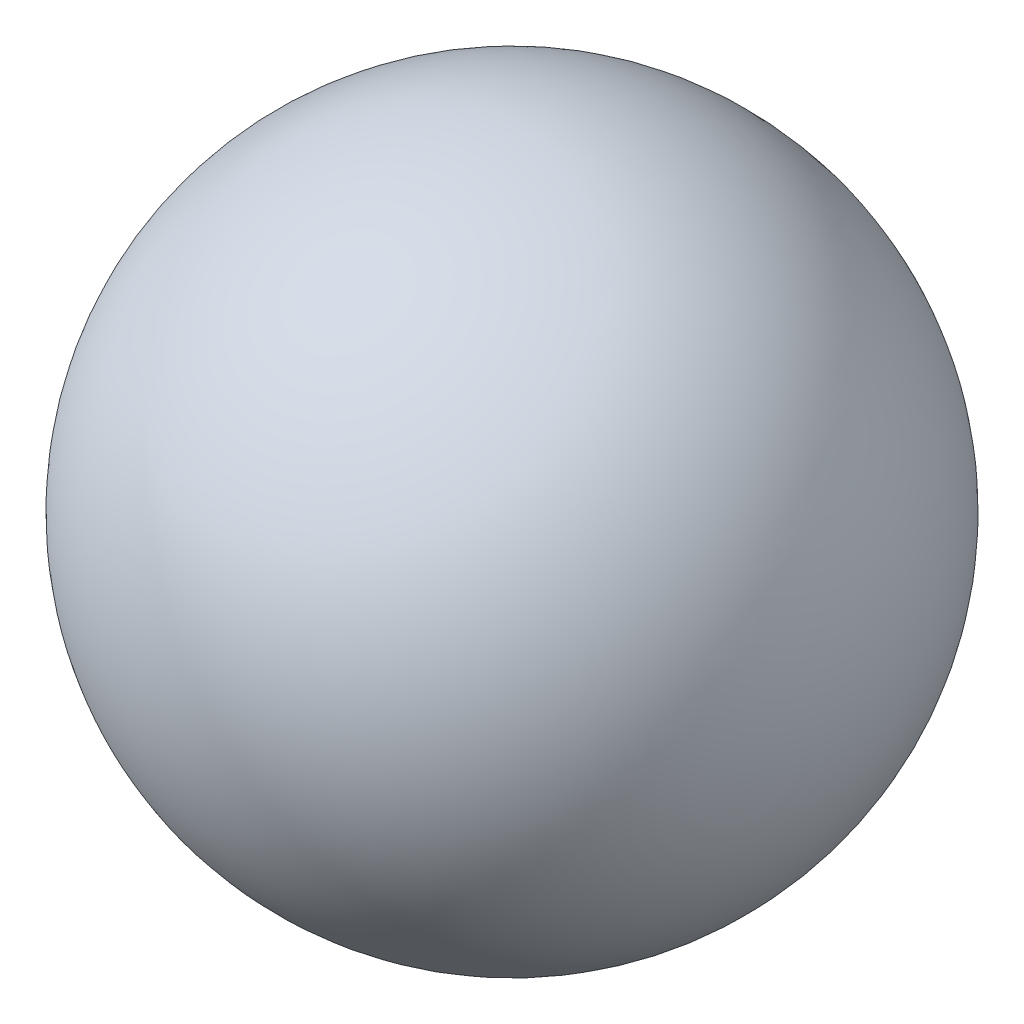
ISO-10303-21;
HEADER;
FILE_DESCRIPTION(('STEP AP214'),'2;1');
FILE_NAME('part.step','',(''),(''),'','','');
FILE_SCHEMA(('AUTOMOTIVE_DESIGN { 1 0 10303 214 1 1 1 1 }'));
ENDSEC;
DATA;
#1=APPLICATION_CONTEXT('core data for automotive mechanical design processes');
#2=APPLICATION_PROTOCOL_DEFINITION('international standard','automotive_design',2000,#1);
#3=PRODUCT_CONTEXT('',#1,'mechanical');
#4=PRODUCT('Part','Part','',(#3));
#5=PRODUCT_RELATED_PRODUCT_CATEGORY('part','',(#4));
#6=PRODUCT_DEFINITION_FORMATION('','',#4);
#7=PRODUCT_DEFINITION_CONTEXT('part definition',#1,'design');
#8=PRODUCT_DEFINITION('design','',#6,#7);
#9=PRODUCT_DEFINITION_SHAPE('','',#8);
#10=(LENGTH_UNIT() NAMED_UNIT(*) SI_UNIT(.MILLI.,.METRE.));
#11=(NAMED_UNIT(*) PLANE_ANGLE_UNIT() SI_UNIT($,.RADIAN.));
#12=(NAMED_UNIT(*) SI_UNIT($,.STERADIAN.) SOLID_ANGLE_UNIT());
#13=UNCERTAINTY_MEASURE_WITH_UNIT(LENGTH_MEASURE(1.E-05),#10,'distance_accuracy_value','');
#14=(GEOMETRIC_REPRESENTATION_CONTEXT(3) GLOBAL_UNCERTAINTY_ASSIGNED_CONTEXT((#13)) GLOBAL_UNIT_ASSIGNED_CONTEXT((#10,
#11,#12)) REPRESENTATION_CONTEXT('',''));
#15=CARTESIAN_POINT('',(0.,0.,0.));
#16=DIRECTION('',(0.,0.,1.));
#17=DIRECTION('',(1.,0.,0.));
#18=AXIS2_PLACEMENT_3D('',#15,#16,#17);
#19=CARTESIAN_POINT('',(64.16,0.605473212483679,-69.3803581079614));
#20=DIRECTION('',(0.,0.00872653549837383,-0.999961923064171));
#21=DIRECTION('',(0.173648177666934,0.984770254550592,0.0085939598157348));
#22=AXIS2_PLACEMENT_3D('',#19,#20,#21);
#23=SPHERICAL_SURFACE('',#22,7.15);
#24=CARTESIAN_POINT('',(64.16,0.543078483670306,-62.2306303580526));
#25=VERTEX_POINT('',#24);
#26=VERTEX_LOOP('',#25);
#27=FACE_BOUND('',#26,.T.);
#28=CARTESIAN_POINT('',(64.16,0.667867941297053,-76.5300858578702));
#29=VERTEX_POINT('',#28);
#30=VERTEX_LOOP('',#29);
#31=FACE_BOUND('',#30,.T.);
#32=ADVANCED_FACE('F16',(#27,#31),#23,.T.);
#33=CLOSED_SHELL('',(#32));
#34=MANIFOLD_SOLID_BREP('B1',#33);
#35=ADVANCED_BREP_SHAPE_REPRESENTATION('',(#18,#34),#14);
#36=SHAPE_DEFINITION_REPRESENTATION(#9,#35);
ENDSEC;
END-ISO-10303-21;
